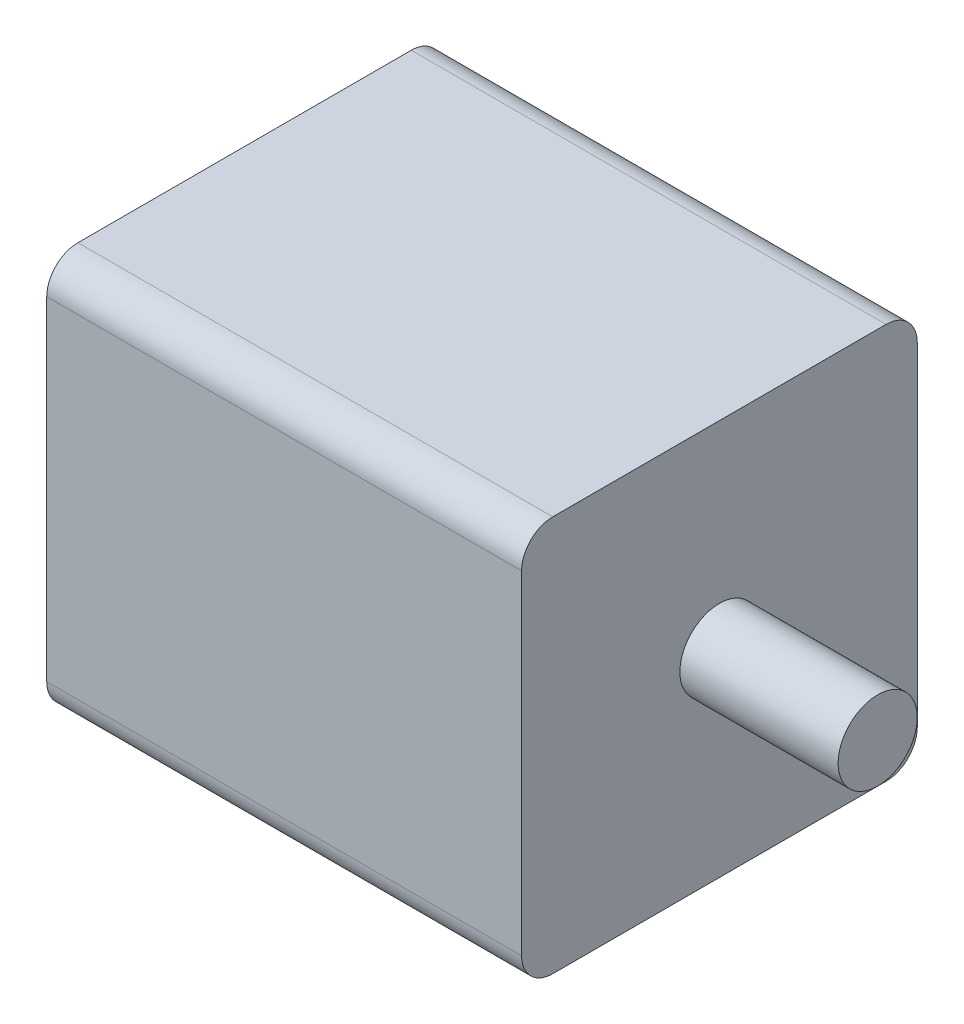
ISO-10303-21;
HEADER;
FILE_DESCRIPTION(('STEP AP214'),'2;1');
FILE_NAME('part.step','',(''),(''),'','','');
FILE_SCHEMA(('AUTOMOTIVE_DESIGN { 1 0 10303 214 1 1 1 1 }'));
ENDSEC;
DATA;
#1=APPLICATION_CONTEXT('core data for automotive mechanical design processes');
#2=APPLICATION_PROTOCOL_DEFINITION('international standard','automotive_design',2000,#1);
#3=PRODUCT_CONTEXT('',#1,'mechanical');
#4=PRODUCT('Part','Part','',(#3));
#5=PRODUCT_RELATED_PRODUCT_CATEGORY('part','',(#4));
#6=PRODUCT_DEFINITION_FORMATION('','',#4);
#7=PRODUCT_DEFINITION_CONTEXT('part definition',#1,'design');
#8=PRODUCT_DEFINITION('design','',#6,#7);
#9=PRODUCT_DEFINITION_SHAPE('','',#8);
#10=(LENGTH_UNIT() NAMED_UNIT(*) SI_UNIT(.MILLI.,.METRE.));
#11=(NAMED_UNIT(*) PLANE_ANGLE_UNIT() SI_UNIT($,.RADIAN.));
#12=(NAMED_UNIT(*) SI_UNIT($,.STERADIAN.) SOLID_ANGLE_UNIT());
#13=UNCERTAINTY_MEASURE_WITH_UNIT(LENGTH_MEASURE(1.E-05),#10,'distance_accuracy_value','');
#14=(GEOMETRIC_REPRESENTATION_CONTEXT(3) GLOBAL_UNCERTAINTY_ASSIGNED_CONTEXT((#13)) GLOBAL_UNIT_ASSIGNED_CONTEXT((#10,
#11,#12)) REPRESENTATION_CONTEXT('',''));
#15=CARTESIAN_POINT('',(0.,0.,0.));
#16=DIRECTION('',(0.,0.,1.));
#17=DIRECTION('',(1.,0.,0.));
#18=AXIS2_PLACEMENT_3D('',#15,#16,#17);
#19=CARTESIAN_POINT('',(76.2,-53.5,53.5));
#20=DIRECTION('',(-1.,0.,0.));
#21=DIRECTION('',(0.,0.,1.));
#22=AXIS2_PLACEMENT_3D('',#19,#20,#21);
#23=CYLINDRICAL_SURFACE('',#22,10.);
#24=CARTESIAN_POINT('',(-76.2,-53.5,53.5));
#25=DIRECTION('',(1.,0.,0.));
#26=DIRECTION('',(0.,0.,-1.));
#27=AXIS2_PLACEMENT_3D('',#24,#25,#26);
#28=CIRCLE('',#27,10.);
#29=CARTESIAN_POINT('',(-76.2,-53.4999999999999,63.5));
#30=VERTEX_POINT('',#29);
#31=CARTESIAN_POINT('',(-76.2,-63.5,53.4999999999999));
#32=VERTEX_POINT('',#31);
#33=EDGE_CURVE('E133',#30,#32,#28,.T.);
#34=ORIENTED_EDGE('',*,*,#33,.T.);
#35=DIRECTION('',(-1.,0.,0.));
#36=VECTOR('',#35,1.);
#37=CARTESIAN_POINT('',(76.2,-63.5,53.4999999999999));
#38=LINE('',#37,#36);
#39=CARTESIAN_POINT('',(76.2,-63.5,53.4999999999999));
#40=VERTEX_POINT('',#39);
#41=EDGE_CURVE('E11',#40,#32,#38,.T.);
#42=ORIENTED_EDGE('',*,*,#41,.F.);
#43=CARTESIAN_POINT('',(76.2,-53.5,53.5));
#44=DIRECTION('',(1.,0.,0.));
#45=DIRECTION('',(0.,0.,-1.));
#46=AXIS2_PLACEMENT_3D('',#43,#44,#45);
#47=CIRCLE('',#46,10.);
#48=CARTESIAN_POINT('',(76.2,-53.4999999999999,63.5));
#49=VERTEX_POINT('',#48);
#50=EDGE_CURVE('E148',#49,#40,#47,.T.);
#51=ORIENTED_EDGE('',*,*,#50,.F.);
#52=DIRECTION('',(-1.,0.,0.));
#53=VECTOR('',#52,1.);
#54=CARTESIAN_POINT('',(76.2,-53.4999999999999,63.5));
#55=LINE('',#54,#53);
#56=EDGE_CURVE('E129',#49,#30,#55,.T.);
#57=ORIENTED_EDGE('',*,*,#56,.T.);
#58=EDGE_LOOP('',(#34,#42,#51,#57));
#59=FACE_BOUND('',#58,.T.);
#60=ADVANCED_FACE('F37',(#59),#23,.T.);
#61=CARTESIAN_POINT('',(76.2,-63.5,53.4999999999999));
#62=DIRECTION('',(0.,1.,0.));
#63=DIRECTION('',(0.,0.,1.));
#64=AXIS2_PLACEMENT_3D('',#61,#62,#63);
#65=PLANE('',#64);
#66=DIRECTION('',(0.,0.,-1.));
#67=VECTOR('',#66,1.);
#68=CARTESIAN_POINT('',(-76.2,-63.5,53.4999999999999));
#69=LINE('',#68,#67);
#70=CARTESIAN_POINT('',(-76.2,-63.5,-53.4999999999999));
#71=VERTEX_POINT('',#70);
#72=EDGE_CURVE('E136',#32,#71,#69,.T.);
#73=ORIENTED_EDGE('',*,*,#72,.T.);
#74=DIRECTION('',(-1.,0.,0.));
#75=VECTOR('',#74,1.);
#76=CARTESIAN_POINT('',(76.2,-63.5,-53.4999999999999));
#77=LINE('',#76,#75);
#78=CARTESIAN_POINT('',(76.2,-63.5,-53.4999999999999));
#79=VERTEX_POINT('',#78);
#80=EDGE_CURVE('E45',#79,#71,#77,.T.);
#81=ORIENTED_EDGE('',*,*,#80,.F.);
#82=DIRECTION('',(0.,0.,-1.));
#83=VECTOR('',#82,1.);
#84=CARTESIAN_POINT('',(76.2,-63.5,53.4999999999999));
#85=LINE('',#84,#83);
#86=EDGE_CURVE('E96',#40,#79,#85,.T.);
#87=ORIENTED_EDGE('',*,*,#86,.F.);
#88=ORIENTED_EDGE('',*,*,#41,.T.);
#89=EDGE_LOOP('',(#73,#81,#87,#88));
#90=FACE_BOUND('',#89,.T.);
#91=ADVANCED_FACE('F205',(#90),#65,.F.);
#92=CARTESIAN_POINT('',(76.2,-53.5,-53.5));
#93=DIRECTION('',(-1.,0.,0.));
#94=DIRECTION('',(0.,0.,1.));
#95=AXIS2_PLACEMENT_3D('',#92,#93,#94);
#96=CYLINDRICAL_SURFACE('',#95,10.);
#97=CARTESIAN_POINT('',(-76.2,-53.5,-53.5));
#98=DIRECTION('',(1.,0.,0.));
#99=DIRECTION('',(0.,0.,-1.));
#100=AXIS2_PLACEMENT_3D('',#97,#98,#99);
#101=CIRCLE('',#100,10.);
#102=CARTESIAN_POINT('',(-76.2,-53.4999999999999,-63.5));
#103=VERTEX_POINT('',#102);
#104=EDGE_CURVE('E139',#71,#103,#101,.T.);
#105=ORIENTED_EDGE('',*,*,#104,.T.);
#106=DIRECTION('',(-1.,0.,0.));
#107=VECTOR('',#106,1.);
#108=CARTESIAN_POINT('',(76.2,-53.4999999999999,-63.5));
#109=LINE('',#108,#107);
#110=CARTESIAN_POINT('',(76.2,-53.4999999999999,-63.5));
#111=VERTEX_POINT('',#110);
#112=EDGE_CURVE('E155',#111,#103,#109,.T.);
#113=ORIENTED_EDGE('',*,*,#112,.F.);
#114=CARTESIAN_POINT('',(76.2,-53.5,-53.5));
#115=DIRECTION('',(1.,0.,0.));
#116=DIRECTION('',(0.,0.,-1.));
#117=AXIS2_PLACEMENT_3D('',#114,#115,#116);
#118=CIRCLE('',#117,10.);
#119=EDGE_CURVE('E163',#79,#111,#118,.T.);
#120=ORIENTED_EDGE('',*,*,#119,.F.);
#121=ORIENTED_EDGE('',*,*,#80,.T.);
#122=EDGE_LOOP('',(#105,#113,#120,#121));
#123=FACE_BOUND('',#122,.T.);
#124=ADVANCED_FACE('F161',(#123),#96,.T.);
#125=CARTESIAN_POINT('',(76.2,53.4999999999999,-63.5));
#126=DIRECTION('',(0.,0.,1.));
#127=DIRECTION('',(0.,-1.,0.));
#128=AXIS2_PLACEMENT_3D('',#125,#126,#127);
#129=PLANE('',#128);
#130=DIRECTION('',(0.,1.,0.));
#131=VECTOR('',#130,1.);
#132=CARTESIAN_POINT('',(-76.2,53.4999999999999,-63.5));
#133=LINE('',#132,#131);
#134=CARTESIAN_POINT('',(-76.2,53.4999999999999,-63.5));
#135=VERTEX_POINT('',#134);
#136=EDGE_CURVE('E141',#103,#135,#133,.T.);
#137=ORIENTED_EDGE('',*,*,#136,.T.);
#138=DIRECTION('',(-1.,0.,0.));
#139=VECTOR('',#138,1.);
#140=CARTESIAN_POINT('',(76.2,53.4999999999999,-63.5));
#141=LINE('',#140,#139);
#142=CARTESIAN_POINT('',(76.2,53.4999999999999,-63.5));
#143=VERTEX_POINT('',#142);
#144=EDGE_CURVE('E152',#143,#135,#141,.T.);
#145=ORIENTED_EDGE('',*,*,#144,.F.);
#146=DIRECTION('',(0.,1.,0.));
#147=VECTOR('',#146,1.);
#148=CARTESIAN_POINT('',(76.2,53.4999999999999,-63.5));
#149=LINE('',#148,#147);
#150=EDGE_CURVE('E175',#111,#143,#149,.T.);
#151=ORIENTED_EDGE('',*,*,#150,.F.);
#152=ORIENTED_EDGE('',*,*,#112,.T.);
#153=EDGE_LOOP('',(#137,#145,#151,#152));
#154=FACE_BOUND('',#153,.T.);
#155=ADVANCED_FACE('F171',(#154),#129,.F.);
#156=CARTESIAN_POINT('',(76.2,53.5,-53.5));
#157=DIRECTION('',(-1.,0.,0.));
#158=DIRECTION('',(0.,0.,1.));
#159=AXIS2_PLACEMENT_3D('',#156,#157,#158);
#160=CYLINDRICAL_SURFACE('',#159,10.);
#161=CARTESIAN_POINT('',(-76.2,53.5,-53.5));
#162=DIRECTION('',(1.,0.,0.));
#163=DIRECTION('',(0.,0.,1.));
#164=AXIS2_PLACEMENT_3D('',#161,#162,#163);
#165=CIRCLE('',#164,10.);
#166=CARTESIAN_POINT('',(-76.2,63.5,-53.4999999999999));
#167=VERTEX_POINT('',#166);
#168=EDGE_CURVE('E143',#135,#167,#165,.T.);
#169=ORIENTED_EDGE('',*,*,#168,.T.);
#170=DIRECTION('',(-1.,0.,0.));
#171=VECTOR('',#170,1.);
#172=CARTESIAN_POINT('',(76.2,63.5,-53.4999999999999));
#173=LINE('',#172,#171);
#174=CARTESIAN_POINT('',(76.2,63.5,-53.4999999999999));
#175=VERTEX_POINT('',#174);
#176=EDGE_CURVE('E124',#175,#167,#173,.T.);
#177=ORIENTED_EDGE('',*,*,#176,.F.);
#178=CARTESIAN_POINT('',(76.2,53.5,-53.5));
#179=DIRECTION('',(1.,0.,0.));
#180=DIRECTION('',(0.,0.,1.));
#181=AXIS2_PLACEMENT_3D('',#178,#179,#180);
#182=CIRCLE('',#181,10.);
#183=EDGE_CURVE('E115',#143,#175,#182,.T.);
#184=ORIENTED_EDGE('',*,*,#183,.F.);
#185=ORIENTED_EDGE('',*,*,#144,.T.);
#186=EDGE_LOOP('',(#169,#177,#184,#185));
#187=FACE_BOUND('',#186,.T.);
#188=ADVANCED_FACE('F174',(#187),#160,.T.);
#189=CARTESIAN_POINT('',(76.2,63.5,53.4999999999999));
#190=DIRECTION('',(0.,-1.,0.));
#191=DIRECTION('',(0.,0.,-1.));
#192=AXIS2_PLACEMENT_3D('',#189,#190,#191);
#193=PLANE('',#192);
#194=DIRECTION('',(0.,0.,1.));
#195=VECTOR('',#194,1.);
#196=CARTESIAN_POINT('',(-76.2,63.5,53.4999999999999));
#197=LINE('',#196,#195);
#198=CARTESIAN_POINT('',(-76.2,63.5,53.4999999999999));
#199=VERTEX_POINT('',#198);
#200=EDGE_CURVE('E123',#167,#199,#197,.T.);
#201=ORIENTED_EDGE('',*,*,#200,.T.);
#202=DIRECTION('',(-1.,0.,0.));
#203=VECTOR('',#202,1.);
#204=CARTESIAN_POINT('',(76.2,63.5,53.4999999999999));
#205=LINE('',#204,#203);
#206=CARTESIAN_POINT('',(76.2,63.5,53.4999999999999));
#207=VERTEX_POINT('',#206);
#208=EDGE_CURVE('E120',#207,#199,#205,.T.);
#209=ORIENTED_EDGE('',*,*,#208,.F.);
#210=DIRECTION('',(0.,0.,1.));
#211=VECTOR('',#210,1.);
#212=CARTESIAN_POINT('',(76.2,63.5,53.4999999999999));
#213=LINE('',#212,#211);
#214=EDGE_CURVE('E109',#175,#207,#213,.T.);
#215=ORIENTED_EDGE('',*,*,#214,.F.);
#216=ORIENTED_EDGE('',*,*,#176,.T.);
#217=EDGE_LOOP('',(#201,#209,#215,#216));
#218=FACE_BOUND('',#217,.T.);
#219=ADVANCED_FACE('F121',(#218),#193,.F.);
#220=CARTESIAN_POINT('',(76.2,53.5,53.5));
#221=DIRECTION('',(-1.,0.,0.));
#222=DIRECTION('',(0.,0.,1.));
#223=AXIS2_PLACEMENT_3D('',#220,#221,#222);
#224=CYLINDRICAL_SURFACE('',#223,10.);
#225=CARTESIAN_POINT('',(-76.2,53.5,53.5));
#226=DIRECTION('',(1.,0.,0.));
#227=DIRECTION('',(0.,0.,-1.));
#228=AXIS2_PLACEMENT_3D('',#225,#226,#227);
#229=CIRCLE('',#228,10.);
#230=CARTESIAN_POINT('',(-76.2,53.4999999999999,63.5));
#231=VERTEX_POINT('',#230);
#232=EDGE_CURVE('E82',#199,#231,#229,.T.);
#233=ORIENTED_EDGE('',*,*,#232,.T.);
#234=DIRECTION('',(-1.,0.,0.));
#235=VECTOR('',#234,1.);
#236=CARTESIAN_POINT('',(76.2,53.4999999999999,63.5));
#237=LINE('',#236,#235);
#238=CARTESIAN_POINT('',(76.2,53.4999999999999,63.5));
#239=VERTEX_POINT('',#238);
#240=EDGE_CURVE('E125',#239,#231,#237,.T.);
#241=ORIENTED_EDGE('',*,*,#240,.F.);
#242=CARTESIAN_POINT('',(76.2,53.5,53.5));
#243=DIRECTION('',(1.,0.,0.));
#244=DIRECTION('',(0.,0.,-1.));
#245=AXIS2_PLACEMENT_3D('',#242,#243,#244);
#246=CIRCLE('',#245,10.);
#247=EDGE_CURVE('E113',#207,#239,#246,.T.);
#248=ORIENTED_EDGE('',*,*,#247,.F.);
#249=ORIENTED_EDGE('',*,*,#208,.T.);
#250=EDGE_LOOP('',(#233,#241,#248,#249));
#251=FACE_BOUND('',#250,.T.);
#252=ADVANCED_FACE('F127',(#251),#224,.T.);
#253=CARTESIAN_POINT('',(76.2,53.4999999999999,63.5));
#254=DIRECTION('',(0.,0.,-1.));
#255=DIRECTION('',(0.,1.,0.));
#256=AXIS2_PLACEMENT_3D('',#253,#254,#255);
#257=PLANE('',#256);
#258=DIRECTION('',(0.,-1.,0.));
#259=VECTOR('',#258,1.);
#260=CARTESIAN_POINT('',(-76.2,53.4999999999999,63.5));
#261=LINE('',#260,#259);
#262=EDGE_CURVE('E88',#231,#30,#261,.T.);
#263=ORIENTED_EDGE('',*,*,#262,.T.);
#264=ORIENTED_EDGE('',*,*,#56,.F.);
#265=DIRECTION('',(0.,-1.,0.));
#266=VECTOR('',#265,1.);
#267=CARTESIAN_POINT('',(76.2,53.4999999999999,63.5));
#268=LINE('',#267,#266);
#269=EDGE_CURVE('E53',#239,#49,#268,.T.);
#270=ORIENTED_EDGE('',*,*,#269,.F.);
#271=ORIENTED_EDGE('',*,*,#240,.T.);
#272=EDGE_LOOP('',(#263,#264,#270,#271));
#273=FACE_BOUND('',#272,.T.);
#274=ADVANCED_FACE('F196',(#273),#257,.F.);
#275=CARTESIAN_POINT('',(76.2,-53.5,53.5));
#276=DIRECTION('',(1.,0.,0.));
#277=DIRECTION('',(0.,0.,-1.));
#278=AXIS2_PLACEMENT_3D('',#275,#276,#277);
#279=PLANE('',#278);
#280=CARTESIAN_POINT('',(76.2,0.,0.));
#281=DIRECTION('',(1.,0.,0.));
#282=DIRECTION('',(0.,0.,-1.));
#283=AXIS2_PLACEMENT_3D('',#280,#281,#282);
#284=CIRCLE('',#283,12.7);
#285=CARTESIAN_POINT('',(76.2,0.,-12.7));
#286=VERTEX_POINT('',#285);
#287=EDGE_CURVE('E181',#286,#286,#284,.T.);
#288=ORIENTED_EDGE('',*,*,#287,.F.);
#289=EDGE_LOOP('',(#288));
#290=FACE_BOUND('',#289,.T.);
#291=ORIENTED_EDGE('',*,*,#50,.T.);
#292=ORIENTED_EDGE('',*,*,#86,.T.);
#293=ORIENTED_EDGE('',*,*,#119,.T.);
#294=ORIENTED_EDGE('',*,*,#150,.T.);
#295=ORIENTED_EDGE('',*,*,#183,.T.);
#296=ORIENTED_EDGE('',*,*,#214,.T.);
#297=ORIENTED_EDGE('',*,*,#247,.T.);
#298=ORIENTED_EDGE('',*,*,#269,.T.);
#299=EDGE_LOOP('',(#291,#292,#293,#294,#295,#296,#297,#298));
#300=FACE_BOUND('',#299,.T.);
#301=ADVANCED_FACE('F111',(#290,#300),#279,.T.);
#302=CARTESIAN_POINT('',(-76.2,-53.5,53.5));
#303=DIRECTION('',(1.,0.,0.));
#304=DIRECTION('',(0.,0.,-1.));
#305=AXIS2_PLACEMENT_3D('',#302,#303,#304);
#306=PLANE('',#305);
#307=ORIENTED_EDGE('',*,*,#33,.F.);
#308=ORIENTED_EDGE('',*,*,#262,.F.);
#309=ORIENTED_EDGE('',*,*,#232,.F.);
#310=ORIENTED_EDGE('',*,*,#200,.F.);
#311=ORIENTED_EDGE('',*,*,#168,.F.);
#312=ORIENTED_EDGE('',*,*,#136,.F.);
#313=ORIENTED_EDGE('',*,*,#104,.F.);
#314=ORIENTED_EDGE('',*,*,#72,.F.);
#315=EDGE_LOOP('',(#307,#308,#309,#310,#311,#312,#313,#314));
#316=FACE_BOUND('',#315,.T.);
#317=ADVANCED_FACE('F167',(#316),#306,.F.);
#318=CARTESIAN_POINT('',(127.,0.,0.));
#319=DIRECTION('',(-1.,0.,0.));
#320=DIRECTION('',(0.,0.,1.));
#321=AXIS2_PLACEMENT_3D('',#318,#319,#320);
#322=CYLINDRICAL_SURFACE('',#321,12.7);
#323=CARTESIAN_POINT('',(127.,0.,0.));
#324=DIRECTION('',(1.,0.,0.));
#325=DIRECTION('',(0.,0.,-1.));
#326=AXIS2_PLACEMENT_3D('',#323,#324,#325);
#327=CIRCLE('',#326,12.7);
#328=CARTESIAN_POINT('',(127.,0.,-12.7));
#329=VERTEX_POINT('',#328);
#330=EDGE_CURVE('E137',#329,#329,#327,.T.);
#331=ORIENTED_EDGE('',*,*,#330,.F.);
#332=EDGE_LOOP('',(#331));
#333=FACE_BOUND('',#332,.T.);
#334=ORIENTED_EDGE('',*,*,#287,.T.);
#335=EDGE_LOOP('',(#334));
#336=FACE_BOUND('',#335,.T.);
#337=ADVANCED_FACE('F189',(#333,#336),#322,.T.);
#338=CARTESIAN_POINT('',(127.,0.,0.));
#339=DIRECTION('',(1.,0.,0.));
#340=DIRECTION('',(0.,0.,-1.));
#341=AXIS2_PLACEMENT_3D('',#338,#339,#340);
#342=PLANE('',#341);
#343=ORIENTED_EDGE('',*,*,#330,.T.);
#344=EDGE_LOOP('',(#343));
#345=FACE_BOUND('',#344,.T.);
#346=ADVANCED_FACE('F187',(#345),#342,.T.);
#347=CLOSED_SHELL('',(#60,#91,#124,#155,#188,#219,#252,#274,#301,#317,#337,#346));
#348=MANIFOLD_SOLID_BREP('B2',#347);
#349=ADVANCED_BREP_SHAPE_REPRESENTATION('',(#18,#348),#14);
#350=SHAPE_DEFINITION_REPRESENTATION(#9,#349);
ENDSEC;
END-ISO-10303-21;
